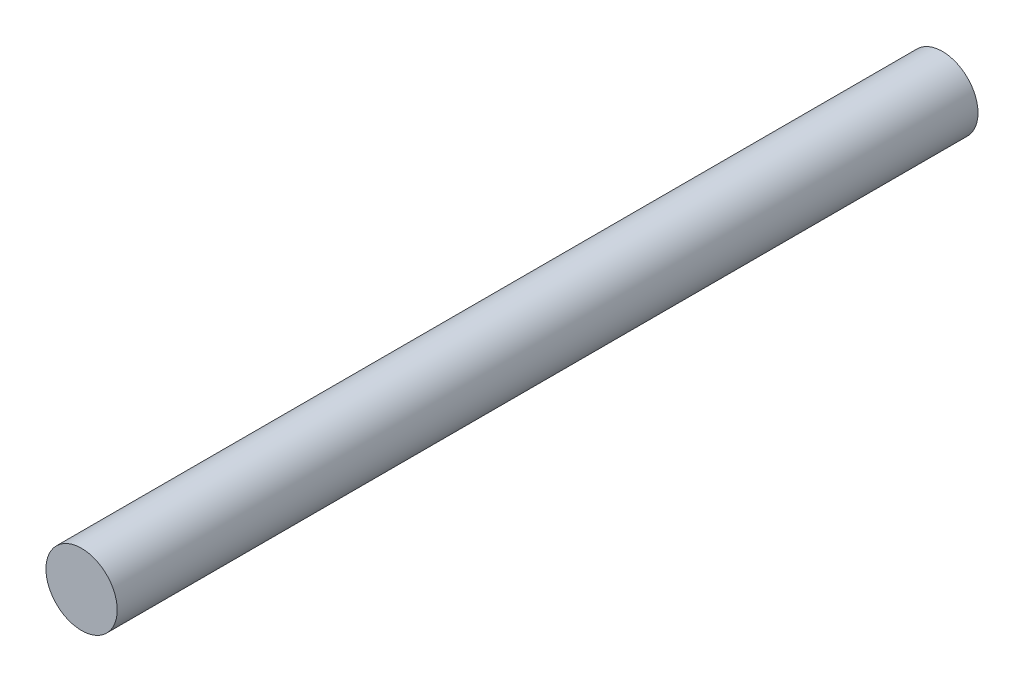
ISO-10303-21;
HEADER;
FILE_DESCRIPTION(('STEP AP214'),'2;1');
FILE_NAME('part.step','',(''),(''),'','','');
FILE_SCHEMA(('AUTOMOTIVE_DESIGN { 1 0 10303 214 1 1 1 1 }'));
ENDSEC;
DATA;
#1=APPLICATION_CONTEXT('core data for automotive mechanical design processes');
#2=APPLICATION_PROTOCOL_DEFINITION('international standard','automotive_design',2000,#1);
#3=PRODUCT_CONTEXT('',#1,'mechanical');
#4=PRODUCT('Part','Part','',(#3));
#5=PRODUCT_RELATED_PRODUCT_CATEGORY('part','',(#4));
#6=PRODUCT_DEFINITION_FORMATION('','',#4);
#7=PRODUCT_DEFINITION_CONTEXT('part definition',#1,'design');
#8=PRODUCT_DEFINITION('design','',#6,#7);
#9=PRODUCT_DEFINITION_SHAPE('','',#8);
#10=(LENGTH_UNIT() NAMED_UNIT(*) SI_UNIT(.MILLI.,.METRE.));
#11=(NAMED_UNIT(*) PLANE_ANGLE_UNIT() SI_UNIT($,.RADIAN.));
#12=(NAMED_UNIT(*) SI_UNIT($,.STERADIAN.) SOLID_ANGLE_UNIT());
#13=UNCERTAINTY_MEASURE_WITH_UNIT(LENGTH_MEASURE(1.E-05),#10,'distance_accuracy_value','');
#14=(GEOMETRIC_REPRESENTATION_CONTEXT(3) GLOBAL_UNCERTAINTY_ASSIGNED_CONTEXT((#13)) GLOBAL_UNIT_ASSIGNED_CONTEXT((#10,
#11,#12)) REPRESENTATION_CONTEXT('',''));
#15=CARTESIAN_POINT('',(0.,0.,0.));
#16=DIRECTION('',(0.,0.,1.));
#17=DIRECTION('',(1.,0.,0.));
#18=AXIS2_PLACEMENT_3D('',#15,#16,#17);
#19=CARTESIAN_POINT('',(0.,0.,63.5));
#20=DIRECTION('',(0.,0.,-1.));
#21=DIRECTION('',(-1.,0.,0.));
#22=AXIS2_PLACEMENT_3D('',#19,#20,#21);
#23=CYLINDRICAL_SURFACE('',#22,2.6289);
#24=CARTESIAN_POINT('',(0.,0.,63.5));
#25=DIRECTION('',(0.,0.,1.));
#26=DIRECTION('',(1.,0.,0.));
#27=AXIS2_PLACEMENT_3D('',#24,#25,#26);
#28=CIRCLE('',#27,2.6289);
#29=CARTESIAN_POINT('',(2.6289,0.,63.5));
#30=VERTEX_POINT('',#29);
#31=EDGE_CURVE('E10',#30,#30,#28,.T.);
#32=ORIENTED_EDGE('',*,*,#31,.F.);
#33=EDGE_LOOP('',(#32));
#34=FACE_BOUND('',#33,.T.);
#35=CARTESIAN_POINT('',(0.,0.,0.));
#36=DIRECTION('',(0.,0.,1.));
#37=DIRECTION('',(1.,0.,0.));
#38=AXIS2_PLACEMENT_3D('',#35,#36,#37);
#39=CIRCLE('',#38,2.6289);
#40=CARTESIAN_POINT('',(2.6289,0.,0.));
#41=VERTEX_POINT('',#40);
#42=EDGE_CURVE('E36',#41,#41,#39,.T.);
#43=ORIENTED_EDGE('',*,*,#42,.T.);
#44=EDGE_LOOP('',(#43));
#45=FACE_BOUND('',#44,.T.);
#46=ADVANCED_FACE('F33',(#34,#45),#23,.T.);
#47=CARTESIAN_POINT('',(0.,0.,63.5));
#48=DIRECTION('',(0.,0.,1.));
#49=DIRECTION('',(1.,0.,0.));
#50=AXIS2_PLACEMENT_3D('',#47,#48,#49);
#51=PLANE('',#50);
#52=ORIENTED_EDGE('',*,*,#31,.T.);
#53=EDGE_LOOP('',(#52));
#54=FACE_BOUND('',#53,.T.);
#55=ADVANCED_FACE('F48',(#54),#51,.T.);
#56=CARTESIAN_POINT('',(0.,0.,0.));
#57=DIRECTION('',(0.,0.,1.));
#58=DIRECTION('',(1.,0.,0.));
#59=AXIS2_PLACEMENT_3D('',#56,#57,#58);
#60=PLANE('',#59);
#61=ORIENTED_EDGE('',*,*,#42,.F.);
#62=EDGE_LOOP('',(#61));
#63=FACE_BOUND('',#62,.T.);
#64=ADVANCED_FACE('F46',(#63),#60,.F.);
#65=CLOSED_SHELL('',(#46,#55,#64));
#66=MANIFOLD_SOLID_BREP('B2',#65);
#67=ADVANCED_BREP_SHAPE_REPRESENTATION('',(#18,#66),#14);
#68=SHAPE_DEFINITION_REPRESENTATION(#9,#67);
ENDSEC;
END-ISO-10303-21;
